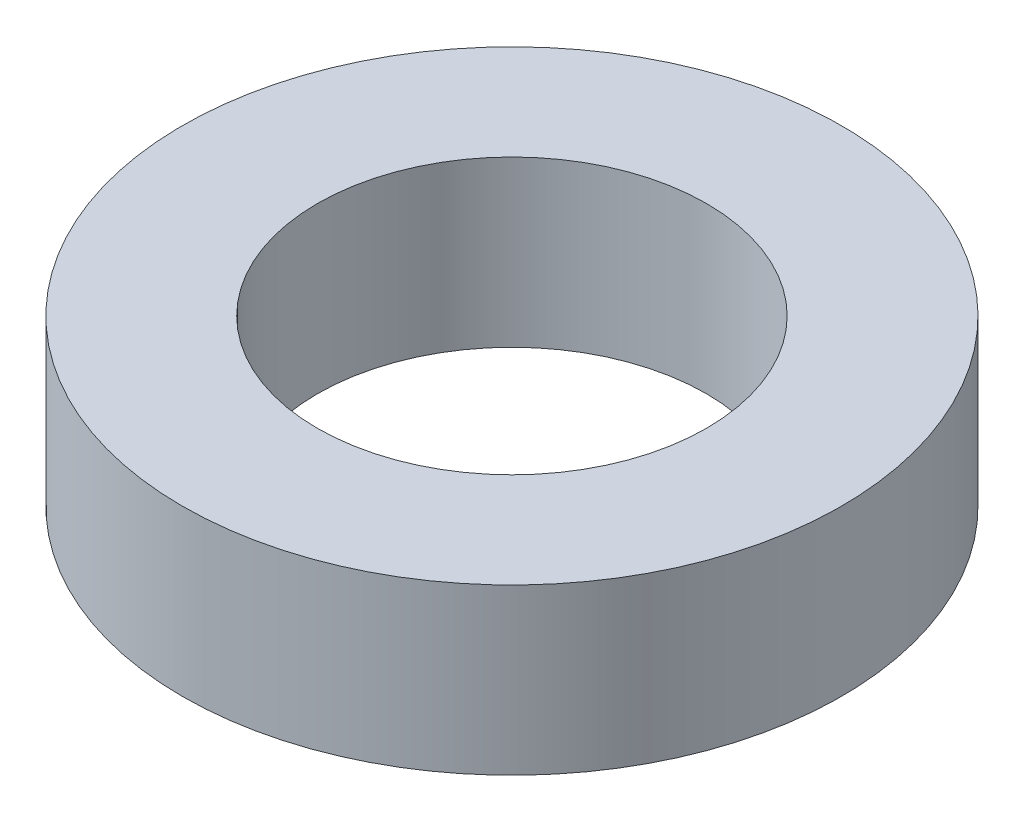
ISO-10303-21;
HEADER;
FILE_DESCRIPTION(('STEP AP214'),'2;1');
FILE_NAME('part.step','',(''),(''),'','','');
FILE_SCHEMA(('AUTOMOTIVE_DESIGN { 1 0 10303 214 1 1 1 1 }'));
ENDSEC;
DATA;
#1=APPLICATION_CONTEXT('core data for automotive mechanical design processes');
#2=APPLICATION_PROTOCOL_DEFINITION('international standard','automotive_design',2000,#1);
#3=PRODUCT_CONTEXT('',#1,'mechanical');
#4=PRODUCT('Part','Part','',(#3));
#5=PRODUCT_RELATED_PRODUCT_CATEGORY('part','',(#4));
#6=PRODUCT_DEFINITION_FORMATION('','',#4);
#7=PRODUCT_DEFINITION_CONTEXT('part definition',#1,'design');
#8=PRODUCT_DEFINITION('design','',#6,#7);
#9=PRODUCT_DEFINITION_SHAPE('','',#8);
#10=(LENGTH_UNIT() NAMED_UNIT(*) SI_UNIT(.MILLI.,.METRE.));
#11=(NAMED_UNIT(*) PLANE_ANGLE_UNIT() SI_UNIT($,.RADIAN.));
#12=(NAMED_UNIT(*) SI_UNIT($,.STERADIAN.) SOLID_ANGLE_UNIT());
#13=UNCERTAINTY_MEASURE_WITH_UNIT(LENGTH_MEASURE(1.E-05),#10,'distance_accuracy_value','');
#14=(GEOMETRIC_REPRESENTATION_CONTEXT(3) GLOBAL_UNCERTAINTY_ASSIGNED_CONTEXT((#13)) GLOBAL_UNIT_ASSIGNED_CONTEXT((#10,
#11,#12)) REPRESENTATION_CONTEXT('',''));
#15=CARTESIAN_POINT('',(0.,0.,0.));
#16=DIRECTION('',(0.,0.,1.));
#17=DIRECTION('',(1.,0.,0.));
#18=AXIS2_PLACEMENT_3D('',#15,#16,#17);
#19=CARTESIAN_POINT('',(0.,3.175,0.));
#20=DIRECTION('',(0.,1.,0.));
#21=DIRECTION('',(0.,0.,1.));
#22=AXIS2_PLACEMENT_3D('',#19,#20,#21);
#23=PLANE('',#22);
#24=CARTESIAN_POINT('',(0.,3.175,0.));
#25=DIRECTION('',(0.,1.,0.));
#26=DIRECTION('',(0.,0.,1.));
#27=AXIS2_PLACEMENT_3D('',#24,#25,#26);
#28=CIRCLE('',#27,6.35);
#29=CARTESIAN_POINT('',(0.,3.175,6.35));
#30=VERTEX_POINT('',#29);
#31=EDGE_CURVE('E10',#30,#30,#28,.T.);
#32=ORIENTED_EDGE('',*,*,#31,.T.);
#33=EDGE_LOOP('',(#32));
#34=FACE_BOUND('',#33,.T.);
#35=CARTESIAN_POINT('',(0.,3.175,0.));
#36=DIRECTION('',(0.,1.,0.));
#37=DIRECTION('',(0.,0.,1.));
#38=AXIS2_PLACEMENT_3D('',#35,#36,#37);
#39=CIRCLE('',#38,3.75);
#40=CARTESIAN_POINT('',(0.,3.175,3.75));
#41=VERTEX_POINT('',#40);
#42=EDGE_CURVE('E25',#41,#41,#39,.T.);
#43=ORIENTED_EDGE('',*,*,#42,.F.);
#44=EDGE_LOOP('',(#43));
#45=FACE_BOUND('',#44,.T.);
#46=ADVANCED_FACE('F14',(#34,#45),#23,.T.);
#47=CARTESIAN_POINT('',(0.,0.,0.));
#48=DIRECTION('',(0.,1.,0.));
#49=DIRECTION('',(0.,0.,1.));
#50=AXIS2_PLACEMENT_3D('',#47,#48,#49);
#51=PLANE('',#50);
#52=CARTESIAN_POINT('',(0.,0.,0.));
#53=DIRECTION('',(0.,1.,0.));
#54=DIRECTION('',(0.,0.,1.));
#55=AXIS2_PLACEMENT_3D('',#52,#53,#54);
#56=CIRCLE('',#55,6.35);
#57=CARTESIAN_POINT('',(0.,0.,6.35));
#58=VERTEX_POINT('',#57);
#59=EDGE_CURVE('E18',#58,#58,#56,.T.);
#60=ORIENTED_EDGE('',*,*,#59,.F.);
#61=EDGE_LOOP('',(#60));
#62=FACE_BOUND('',#61,.T.);
#63=CARTESIAN_POINT('',(0.,0.,0.));
#64=DIRECTION('',(0.,1.,0.));
#65=DIRECTION('',(0.,0.,1.));
#66=AXIS2_PLACEMENT_3D('',#63,#64,#65);
#67=CIRCLE('',#66,3.75);
#68=CARTESIAN_POINT('',(0.,0.,3.75));
#69=VERTEX_POINT('',#68);
#70=EDGE_CURVE('E27',#69,#69,#67,.T.);
#71=ORIENTED_EDGE('',*,*,#70,.T.);
#72=EDGE_LOOP('',(#71));
#73=FACE_BOUND('',#72,.T.);
#74=ADVANCED_FACE('F37',(#62,#73),#51,.F.);
#75=CARTESIAN_POINT('',(0.,3.175,0.));
#76=DIRECTION('',(0.,-1.,0.));
#77=DIRECTION('',(0.,0.,-1.));
#78=AXIS2_PLACEMENT_3D('',#75,#76,#77);
#79=CYLINDRICAL_SURFACE('',#78,6.35);
#80=ORIENTED_EDGE('',*,*,#31,.F.);
#81=EDGE_LOOP('',(#80));
#82=FACE_BOUND('',#81,.T.);
#83=ORIENTED_EDGE('',*,*,#59,.T.);
#84=EDGE_LOOP('',(#83));
#85=FACE_BOUND('',#84,.T.);
#86=ADVANCED_FACE('F16',(#82,#85),#79,.T.);
#87=CARTESIAN_POINT('',(0.,3.175,0.));
#88=DIRECTION('',(0.,-1.,0.));
#89=DIRECTION('',(0.,0.,-1.));
#90=AXIS2_PLACEMENT_3D('',#87,#88,#89);
#91=CYLINDRICAL_SURFACE('',#90,3.75);
#92=ORIENTED_EDGE('',*,*,#42,.T.);
#93=EDGE_LOOP('',(#92));
#94=FACE_BOUND('',#93,.T.);
#95=ORIENTED_EDGE('',*,*,#70,.F.);
#96=EDGE_LOOP('',(#95));
#97=FACE_BOUND('',#96,.T.);
#98=ADVANCED_FACE('F33',(#94,#97),#91,.F.);
#99=CLOSED_SHELL('',(#46,#74,#86,#98));
#100=MANIFOLD_SOLID_BREP('B1',#99);
#101=ADVANCED_BREP_SHAPE_REPRESENTATION('',(#18,#100),#14);
#102=SHAPE_DEFINITION_REPRESENTATION(#9,#101);
ENDSEC;
END-ISO-10303-21;
